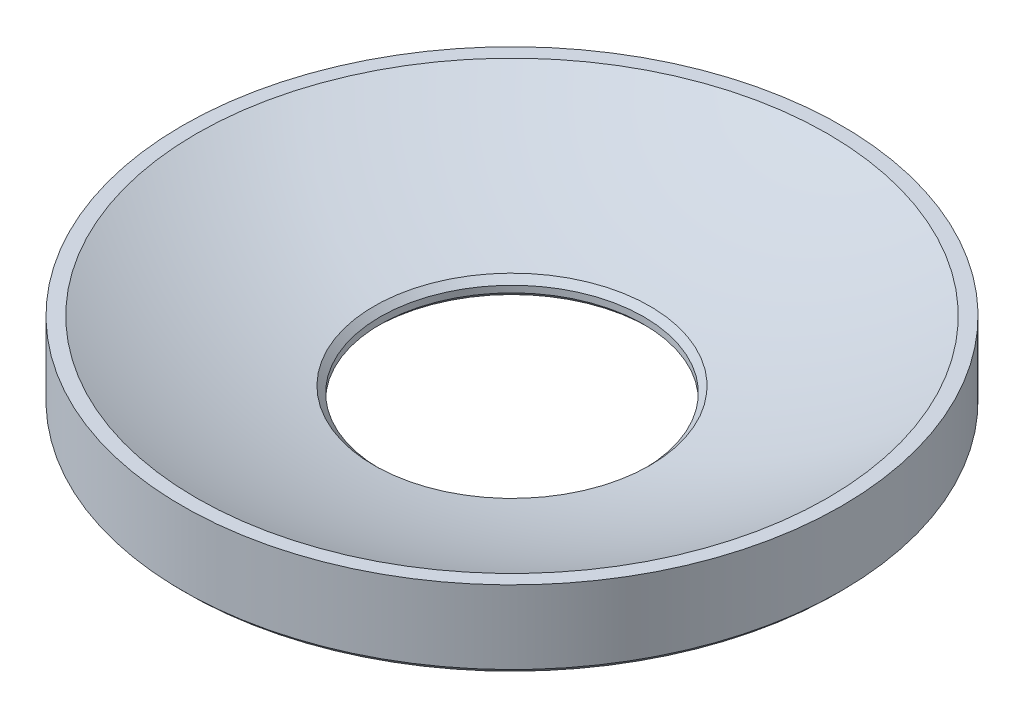
ISO-10303-21;
HEADER;
FILE_DESCRIPTION(('STEP AP214'),'2;1');
FILE_NAME('part.step','',(''),(''),'','','');
FILE_SCHEMA(('AUTOMOTIVE_DESIGN { 1 0 10303 214 1 1 1 1 }'));
ENDSEC;
DATA;
#1=APPLICATION_CONTEXT('core data for automotive mechanical design processes');
#2=APPLICATION_PROTOCOL_DEFINITION('international standard','automotive_design',2000,#1);
#3=PRODUCT_CONTEXT('',#1,'mechanical');
#4=PRODUCT('Part','Part','',(#3));
#5=PRODUCT_RELATED_PRODUCT_CATEGORY('part','',(#4));
#6=PRODUCT_DEFINITION_FORMATION('','',#4);
#7=PRODUCT_DEFINITION_CONTEXT('part definition',#1,'design');
#8=PRODUCT_DEFINITION('design','',#6,#7);
#9=PRODUCT_DEFINITION_SHAPE('','',#8);
#10=(LENGTH_UNIT() NAMED_UNIT(*) SI_UNIT(.MILLI.,.METRE.));
#11=(NAMED_UNIT(*) PLANE_ANGLE_UNIT() SI_UNIT($,.RADIAN.));
#12=(NAMED_UNIT(*) SI_UNIT($,.STERADIAN.) SOLID_ANGLE_UNIT());
#13=UNCERTAINTY_MEASURE_WITH_UNIT(LENGTH_MEASURE(1.E-05),#10,'distance_accuracy_value','');
#14=(GEOMETRIC_REPRESENTATION_CONTEXT(3) GLOBAL_UNCERTAINTY_ASSIGNED_CONTEXT((#13)) GLOBAL_UNIT_ASSIGNED_CONTEXT((#10,
#11,#12)) REPRESENTATION_CONTEXT('',''));
#15=CARTESIAN_POINT('',(0.,0.,0.));
#16=DIRECTION('',(0.,0.,1.));
#17=DIRECTION('',(1.,0.,0.));
#18=AXIS2_PLACEMENT_3D('',#15,#16,#17);
#19=CARTESIAN_POINT('',(0.,0.249260348555203,0.));
#20=DIRECTION('',(0.,-1.,0.));
#21=DIRECTION('',(1.,0.,0.));
#22=AXIS2_PLACEMENT_3D('',#19,#20,#21);
#23=CYLINDRICAL_SURFACE('',#22,20.);
#24=CARTESIAN_POINT('',(0.,0.300000000000005,0.));
#25=DIRECTION('',(0.,-1.,0.));
#26=DIRECTION('',(1.,0.,0.));
#27=AXIS2_PLACEMENT_3D('',#24,#25,#26);
#28=CIRCLE('',#27,20.);
#29=CARTESIAN_POINT('',(-20.,0.300000000000006,0.));
#30=VERTEX_POINT('',#29);
#31=EDGE_CURVE('E10',#30,#30,#28,.F.);
#32=ORIENTED_EDGE('',*,*,#31,.T.);
#33=EDGE_LOOP('',(#32));
#34=FACE_BOUND('',#33,.T.);
#35=CARTESIAN_POINT('',(0.,4.74926034855551,0.));
#36=DIRECTION('',(0.,-1.,0.));
#37=DIRECTION('',(1.,0.,0.));
#38=AXIS2_PLACEMENT_3D('',#35,#36,#37);
#39=CIRCLE('',#38,20.);
#40=CARTESIAN_POINT('',(20.,4.74926034855551,0.));
#41=VERTEX_POINT('',#40);
#42=EDGE_CURVE('E57',#41,#41,#39,.T.);
#43=ORIENTED_EDGE('',*,*,#42,.T.);
#44=EDGE_LOOP('',(#43));
#45=FACE_BOUND('',#44,.T.);
#46=ADVANCED_FACE('F31',(#34,#45),#23,.T.);
#47=CARTESIAN_POINT('',(20.,4.74926034855551,0.));
#48=DIRECTION('',(0.,1.,0.));
#49=DIRECTION('',(-1.,0.,0.));
#50=AXIS2_PLACEMENT_3D('',#47,#48,#49);
#51=PLANE('',#50);
#52=CARTESIAN_POINT('',(0.,4.74926034855551,0.));
#53=DIRECTION('',(0.,-1.,0.));
#54=DIRECTION('',(1.,0.,0.));
#55=AXIS2_PLACEMENT_3D('',#52,#53,#54);
#56=CIRCLE('',#55,19.1507180022061);
#57=CARTESIAN_POINT('',(19.1507180022061,4.74926034855551,0.));
#58=VERTEX_POINT('',#57);
#59=EDGE_CURVE('E60',#58,#58,#56,.T.);
#60=ORIENTED_EDGE('',*,*,#59,.T.);
#61=EDGE_LOOP('',(#60));
#62=FACE_BOUND('',#61,.T.);
#63=ORIENTED_EDGE('',*,*,#42,.F.);
#64=EDGE_LOOP('',(#63));
#65=FACE_BOUND('',#64,.T.);
#66=ADVANCED_FACE('F64',(#62,#65),#51,.T.);
#67=CARTESIAN_POINT('',(0.,43.2492603485552,0.));
#68=DIRECTION('',(0.,-1.,0.));
#69=DIRECTION('',(1.,0.,0.));
#70=AXIS2_PLACEMENT_3D('',#67,#68,#69);
#71=SPHERICAL_SURFACE('',#70,43.);
#72=CARTESIAN_POINT('',(0.,1.07217267385787,0.));
#73=DIRECTION('',(0.,1.,0.));
#74=DIRECTION('',(-1.,0.,0.));
#75=AXIS2_PLACEMENT_3D('',#72,#73,#74);
#76=CIRCLE('',#75,8.37217267385787);
#77=CARTESIAN_POINT('',(8.37217267385789,1.07217267385786,0.));
#78=VERTEX_POINT('',#77);
#79=EDGE_CURVE('E54',#78,#78,#76,.F.);
#80=CARTESIAN_POINT('',(8.37217267385789,1.07217267385786,0.));
#81=CARTESIAN_POINT('',(8.48887543388993,1.09533821673783,0.));
#82=CARTESIAN_POINT('',(8.60548204146638,1.11898815275597,0.));
#83=CARTESIAN_POINT('',(8.83849492784714,1.16725512892019,0.));
#84=CARTESIAN_POINT('',(8.95490120665145,1.19187216906628,0.));
#85=CARTESIAN_POINT('',(9.18750541162692,1.24207167133803,0.));
#86=CARTESIAN_POINT('',(9.30370333779808,1.26765413346369,0.));
#87=CARTESIAN_POINT('',(9.53588283170143,1.31978271316843,0.));
#88=CARTESIAN_POINT('',(9.65186439943361,1.34632883074751,0.));
#89=CARTESIAN_POINT('',(9.88360318457021,1.40038289321693,0.));
#90=CARTESIAN_POINT('',(9.99936040197463,1.42789083810728,0.));
#91=CARTESIAN_POINT('',(10.2306425102913,1.48386665950062,0.));
#92=CARTESIAN_POINT('',(10.3461674012036,1.51233453600361,0.));
#93=CARTESIAN_POINT('',(10.5769768963087,1.57022825912333,0.));
#94=CARTESIAN_POINT('',(10.6922615005016,1.59965410574006,0.));
#95=CARTESIAN_POINT('',(10.9225824785168,1.65946174148757,0.));
#96=CARTESIAN_POINT('',(11.0376188523391,1.68984353061837,0.));
#97=CARTESIAN_POINT('',(11.2674354430611,1.75156095795007,0.));
#98=CARTESIAN_POINT('',(11.3822156599607,1.78289659615098,0.));
#99=CARTESIAN_POINT('',(11.6115120279371,1.84651956244763,0.));
#100=CARTESIAN_POINT('',(11.7260281790138,1.87880689054337,0.));
#101=CARTESIAN_POINT('',(11.954788524639,1.94433101188024,0.));
#102=CARTESIAN_POINT('',(12.0690327191875,1.97756780512136,0.));
#103=CARTESIAN_POINT('',(12.2972412797902,2.04498856657641,0.));
#104=CARTESIAN_POINT('',(12.4112056458444,2.07917253479033,0.));
#105=CARTESIAN_POINT('',(12.6388466967739,2.1484852907537,0.));
#106=CARTESIAN_POINT('',(12.7525233816492,2.18361407850315,0.));
#107=CARTESIAN_POINT('',(12.979581237359,2.25481405299769,0.));
#108=CARTESIAN_POINT('',(13.0929624081934,2.29088523974278,0.));
#109=CARTESIAN_POINT('',(13.3194214233217,2.36396752675302,0.));
#110=CARTESIAN_POINT('',(13.4324992676156,2.40097862701816,0.));
#111=CARTESIAN_POINT('',(13.6583438380638,2.47593819082839,0.));
#112=CARTESIAN_POINT('',(13.771110564218,2.51388665437347,0.));
#113=CARTESIAN_POINT('',(13.9963251282255,2.5907183299147,0.));
#114=CARTESIAN_POINT('',(14.1087729660786,2.62960154191085,0.));
#115=CARTESIAN_POINT('',(14.3333420052952,2.70830003511675,0.));
#116=CARTESIAN_POINT('',(14.4454632066586,2.7481153163265,0.));
#117=CARTESIAN_POINT('',(14.6693712472139,2.82867520449815,0.));
#118=CARTESIAN_POINT('',(14.7811580864057,2.86941981146005,0.));
#119=CARTESIAN_POINT('',(15.0043896999752,2.95183554363959,0.));
#120=CARTESIAN_POINT('',(15.1158344743529,2.99350666885724,0.));
#121=CARTESIAN_POINT('',(15.3383742792211,3.07777256621039,0.));
#122=CARTESIAN_POINT('',(15.4494693097117,3.1203673383459,0.));
#123=CARTESIAN_POINT('',(15.6713019718322,3.20647759455321,0.));
#124=CARTESIAN_POINT('',(15.782039603462,3.24999307862501,0.));
#125=CARTESIAN_POINT('',(16.0031498375135,3.33794176028204,0.));
#126=CARTESIAN_POINT('',(16.1135224399352,3.38237495786727,0.));
#127=CARTESIAN_POINT('',(16.3338950103756,3.47215600489306,0.));
#128=CARTESIAN_POINT('',(16.4438949783943,3.51750385433362,0.));
#129=CARTESIAN_POINT('',(16.6635147005091,3.60911108038974,0.));
#130=CARTESIAN_POINT('',(16.7731344546054,3.6553704570053,0.));
#131=CARTESIAN_POINT('',(16.9919861955574,3.74879754991649,0.));
#132=CARTESIAN_POINT('',(17.1012181824133,3.79596526621212,0.));
#133=CARTESIAN_POINT('',(17.3192868622747,3.89120578842225,0.));
#134=CARTESIAN_POINT('',(17.4281235552802,3.93927859433676,0.));
#135=CARTESIAN_POINT('',(17.6453941481098,4.03632598327399,0.));
#136=CARTESIAN_POINT('',(17.7538280479339,4.0853005662967,0.));
#137=CARTESIAN_POINT('',(17.9702855826701,4.18414813511835,0.));
#138=CARTESIAN_POINT('',(18.0783092175823,4.23402112091729,0.));
#139=CARTESIAN_POINT('',(18.2939387796068,4.33466205787817,0.));
#140=CARTESIAN_POINT('',(18.4015447067192,4.38543000904013,0.));
#141=CARTESIAN_POINT('',(18.6163314368985,4.48785738203907,0.));
#142=CARTESIAN_POINT('',(18.7235122399655,4.53951680387605,0.));
#143=CARTESIAN_POINT('',(18.937441343087,4.64372354571728,0.));
#144=CARTESIAN_POINT('',(19.0441896431415,4.69627086572153,0.));
#145=CARTESIAN_POINT('',(19.1507180022061,4.74926034855551,0.));
#146=B_SPLINE_CURVE_WITH_KNOTS('',3,(#80,#81,#82,#83,#84,#85,#86,#87,#88,#89,#90,#91,#92,#93,
#94,#95,#96,#97,#98,#99,#100,#101,#102,#103,#104,#105,#106,#107,#108,#109,#110,#111,#112,#113,
#114,#115,#116,#117,#118,#119,#120,#121,#122,#123,#124,#125,#126,#127,#128,#129,#130,#131,#132,
#133,#134,#135,#136,#137,#138,#139,#140,#141,#142,#143,#144,#145),.UNSPECIFIED.,.F.,.F.,(4,2,2,
2,2,2,2,2,2,2,2,2,2,2,2,2,2,2,2,2,2,2,2,2,2,2,2,2,2,2,2,2,4),(0.,0.356938170276641,
0.713876340553283,1.07081451082994,1.42775268110657,1.78469085138322,2.14162902165986,
2.4985671919365,2.85550536221315,3.21244353248979,3.56938170276643,3.92631987304307,
4.28325804331971,4.64019621359635,4.997134383873,5.35407255414964,5.71101072442629,
6.06794889470292,6.42488706497957,6.78182523525621,7.13876340553286,7.4957015758095,
7.85263974608614,8.20957791636279,8.56651608663943,8.92345425691608,9.28039242719272,
9.63733059746936,9.994268767746,10.3512069380226,10.7081451082993,11.0650832785759,
11.4220214488526),.UNSPECIFIED.);
#147=EDGE_CURVE('BSEAM67',#78,#58,#146,.T.);
#148=ORIENTED_EDGE('',*,*,#79,.T.);
#149=ORIENTED_EDGE('',*,*,#59,.F.);
#150=ORIENTED_EDGE('',*,*,#147,.T.);
#151=ORIENTED_EDGE('',*,*,#147,.F.);
#152=EDGE_LOOP('',(#148,#150,#149,#151));
#153=FACE_BOUND('',#152,.T.);
#154=ADVANCED_FACE('F67',(#153),#71,.F.);
#155=CARTESIAN_POINT('',(0.,0.249260348555203,0.));
#156=DIRECTION('',(0.,-1.,0.));
#157=DIRECTION('',(1.,0.,0.));
#158=AXIS2_PLACEMENT_3D('',#155,#156,#157);
#159=CYLINDRICAL_SURFACE('',#158,8.);
#160=CARTESIAN_POINT('',(0.,0.699999999999978,0.));
#161=DIRECTION('',(0.,1.,0.));
#162=DIRECTION('',(-1.,0.,0.));
#163=AXIS2_PLACEMENT_3D('',#160,#161,#162);
#164=CIRCLE('',#163,8.);
#165=CARTESIAN_POINT('',(-8.,0.699999999999978,0.));
#166=VERTEX_POINT('',#165);
#167=EDGE_CURVE('E46',#166,#166,#164,.T.);
#168=ORIENTED_EDGE('',*,*,#167,.T.);
#169=EDGE_LOOP('',(#168));
#170=FACE_BOUND('',#169,.T.);
#171=CARTESIAN_POINT('',(0.,0.300000000000002,0.));
#172=DIRECTION('',(0.,-1.,0.));
#173=DIRECTION('',(1.,0.,0.));
#174=AXIS2_PLACEMENT_3D('',#171,#172,#173);
#175=CIRCLE('',#174,8.);
#176=CARTESIAN_POINT('',(8.,0.300000000000002,0.));
#177=VERTEX_POINT('',#176);
#178=EDGE_CURVE('E51',#177,#177,#175,.T.);
#179=ORIENTED_EDGE('',*,*,#178,.T.);
#180=EDGE_LOOP('',(#179));
#181=FACE_BOUND('',#180,.T.);
#182=ADVANCED_FACE('F69',(#170,#181),#159,.F.);
#183=CARTESIAN_POINT('',(8.,0.,0.));
#184=DIRECTION('',(0.,-1.,0.));
#185=DIRECTION('',(1.,0.,0.));
#186=AXIS2_PLACEMENT_3D('',#183,#184,#185);
#187=PLANE('',#186);
#188=CARTESIAN_POINT('',(0.,0.,0.));
#189=DIRECTION('',(0.,-1.,0.));
#190=DIRECTION('',(1.,0.,0.));
#191=AXIS2_PLACEMENT_3D('',#188,#189,#190);
#192=CIRCLE('',#191,8.3);
#193=CARTESIAN_POINT('',(8.3,0.,0.));
#194=VERTEX_POINT('',#193);
#195=EDGE_CURVE('E38',#194,#194,#192,.F.);
#196=ORIENTED_EDGE('',*,*,#195,.T.);
#197=EDGE_LOOP('',(#196));
#198=FACE_BOUND('',#197,.T.);
#199=CARTESIAN_POINT('',(0.,0.,0.));
#200=DIRECTION('',(0.,-1.,0.));
#201=DIRECTION('',(1.,0.,0.));
#202=AXIS2_PLACEMENT_3D('',#199,#200,#201);
#203=CIRCLE('',#202,19.7);
#204=CARTESIAN_POINT('',(-19.7,0.,0.));
#205=VERTEX_POINT('',#204);
#206=EDGE_CURVE('E42',#205,#205,#203,.T.);
#207=ORIENTED_EDGE('',*,*,#206,.T.);
#208=EDGE_LOOP('',(#207));
#209=FACE_BOUND('',#208,.T.);
#210=ADVANCED_FACE('F76',(#198,#209),#187,.T.);
#211=CARTESIAN_POINT('',(0.,1.07217267385785,0.));
#212=DIRECTION('',(0.,1.,0.));
#213=DIRECTION('',(-1.,0.,0.));
#214=AXIS2_PLACEMENT_3D('',#211,#212,#213);
#215=CONICAL_SURFACE('',#214,8.37217267385787,0.785398163397434);
#216=ORIENTED_EDGE('',*,*,#167,.F.);
#217=EDGE_LOOP('',(#216));
#218=FACE_BOUND('',#217,.T.);
#219=ORIENTED_EDGE('',*,*,#79,.F.);
#220=EDGE_LOOP('',(#219));
#221=FACE_BOUND('',#220,.T.);
#222=ADVANCED_FACE('F86',(#218,#221),#215,.F.);
#223=CARTESIAN_POINT('',(0.,0.300000000000002,0.));
#224=DIRECTION('',(0.,-1.,0.));
#225=DIRECTION('',(1.,0.,0.));
#226=AXIS2_PLACEMENT_3D('',#223,#224,#225);
#227=CONICAL_SURFACE('',#226,8.,0.785398163397448);
#228=ORIENTED_EDGE('',*,*,#195,.F.);
#229=EDGE_LOOP('',(#228));
#230=FACE_BOUND('',#229,.T.);
#231=ORIENTED_EDGE('',*,*,#178,.F.);
#232=EDGE_LOOP('',(#231));
#233=FACE_BOUND('',#232,.T.);
#234=ADVANCED_FACE('F88',(#230,#233),#227,.F.);
#235=CARTESIAN_POINT('',(0.,0.,0.));
#236=DIRECTION('',(0.,1.,0.));
#237=DIRECTION('',(-1.,0.,0.));
#238=AXIS2_PLACEMENT_3D('',#235,#236,#237);
#239=CONICAL_SURFACE('',#238,19.7,0.785398163397448);
#240=CARTESIAN_POINT('',(-20.,0.300000000000006,0.));
#241=CARTESIAN_POINT('',(-19.996875,0.296875000000005,0.));
#242=CARTESIAN_POINT('',(-19.99375,0.293750000000005,0.));
#243=CARTESIAN_POINT('',(-19.9875,0.287500000000005,0.));
#244=CARTESIAN_POINT('',(-19.984375,0.284375000000006,0.));
#245=CARTESIAN_POINT('',(-19.978125,0.278125000000006,0.));
#246=CARTESIAN_POINT('',(-19.975,0.275000000000005,0.));
#247=CARTESIAN_POINT('',(-19.96875,0.268750000000005,0.));
#248=CARTESIAN_POINT('',(-19.965625,0.265625000000005,0.));
#249=CARTESIAN_POINT('',(-19.959375,0.259375000000005,0.));
#250=CARTESIAN_POINT('',(-19.95625,0.256250000000005,0.));
#251=CARTESIAN_POINT('',(-19.95,0.250000000000005,0.));
#252=CARTESIAN_POINT('',(-19.946875,0.246875000000005,0.));
#253=CARTESIAN_POINT('',(-19.940625,0.240625000000004,0.));
#254=CARTESIAN_POINT('',(-19.9375,0.237500000000004,0.));
#255=CARTESIAN_POINT('',(-19.93125,0.231250000000004,0.));
#256=CARTESIAN_POINT('',(-19.928125,0.228125000000005,0.));
#257=CARTESIAN_POINT('',(-19.921875,0.221875000000005,0.));
#258=CARTESIAN_POINT('',(-19.91875,0.218750000000004,0.));
#259=CARTESIAN_POINT('',(-19.9125,0.212500000000004,0.));
#260=CARTESIAN_POINT('',(-19.909375,0.209375000000004,0.));
#261=CARTESIAN_POINT('',(-19.903125,0.203125000000004,0.));
#262=CARTESIAN_POINT('',(-19.9,0.200000000000004,0.));
#263=CARTESIAN_POINT('',(-19.89375,0.193750000000004,0.));
#264=CARTESIAN_POINT('',(-19.890625,0.190625000000004,0.));
#265=CARTESIAN_POINT('',(-19.884375,0.184375000000003,0.));
#266=CARTESIAN_POINT('',(-19.88125,0.181250000000003,0.));
#267=CARTESIAN_POINT('',(-19.875,0.175000000000003,0.));
#268=CARTESIAN_POINT('',(-19.871875,0.171875000000004,0.));
#269=CARTESIAN_POINT('',(-19.865625,0.165625000000004,0.));
#270=CARTESIAN_POINT('',(-19.8625,0.162500000000003,0.));
#271=CARTESIAN_POINT('',(-19.85625,0.156250000000003,0.));
#272=CARTESIAN_POINT('',(-19.853125,0.153125000000003,0.));
#273=CARTESIAN_POINT('',(-19.846875,0.146875000000003,0.));
#274=CARTESIAN_POINT('',(-19.84375,0.143750000000003,0.));
#275=CARTESIAN_POINT('',(-19.8375,0.137500000000003,0.));
#276=CARTESIAN_POINT('',(-19.834375,0.134375000000002,0.));
#277=CARTESIAN_POINT('',(-19.828125,0.128125000000002,0.));
#278=CARTESIAN_POINT('',(-19.825,0.125000000000003,0.));
#279=CARTESIAN_POINT('',(-19.81875,0.118750000000003,0.));
#280=CARTESIAN_POINT('',(-19.815625,0.115625000000003,0.));
#281=CARTESIAN_POINT('',(-19.809375,0.109375000000002,0.));
#282=CARTESIAN_POINT('',(-19.80625,0.106250000000002,0.));
#283=CARTESIAN_POINT('',(-19.8,0.100000000000002,0.));
#284=CARTESIAN_POINT('',(-19.796875,0.0968750000000023,0.));
#285=CARTESIAN_POINT('',(-19.790625,0.0906250000000024,0.));
#286=CARTESIAN_POINT('',(-19.7875,0.0875000000000021,0.));
#287=CARTESIAN_POINT('',(-19.78125,0.0812500000000016,0.));
#288=CARTESIAN_POINT('',(-19.778125,0.0781250000000014,0.));
#289=CARTESIAN_POINT('',(-19.771875,0.0718750000000015,0.));
#290=CARTESIAN_POINT('',(-19.76875,0.0687500000000018,0.));
#291=CARTESIAN_POINT('',(-19.7625,0.0625000000000019,0.));
#292=CARTESIAN_POINT('',(-19.759375,0.0593750000000016,0.));
#293=CARTESIAN_POINT('',(-19.753125,0.0531250000000011,0.));
#294=CARTESIAN_POINT('',(-19.75,0.0500000000000009,0.));
#295=CARTESIAN_POINT('',(-19.74375,0.043750000000001,0.));
#296=CARTESIAN_POINT('',(-19.740625,0.0406250000000013,0.));
#297=CARTESIAN_POINT('',(-19.734375,0.0343750000000014,0.));
#298=CARTESIAN_POINT('',(-19.73125,0.0312500000000011,0.));
#299=CARTESIAN_POINT('',(-19.725,0.0250000000000007,0.));
#300=CARTESIAN_POINT('',(-19.721875,0.0218750000000004,0.));
#301=CARTESIAN_POINT('',(-19.715625,0.0156250000000004,0.));
#302=CARTESIAN_POINT('',(-19.7125,0.0125000000000006,0.));
#303=CARTESIAN_POINT('',(-19.70625,0.00625000000000108,0.));
#304=CARTESIAN_POINT('',(-19.703125,0.00312500000000129,0.));
#305=CARTESIAN_POINT('',(-19.7,0.,0.));
#306=B_SPLINE_CURVE_WITH_KNOTS('',3,(#240,#241,#242,#243,#244,#245,#246,#247,#248,#249,#250,
#251,#252,#253,#254,#255,#256,#257,#258,#259,#260,#261,#262,#263,#264,#265,#266,#267,#268,#269,
#270,#271,#272,#273,#274,#275,#276,#277,#278,#279,#280,#281,#282,#283,#284,#285,#286,#287,#288,
#289,#290,#291,#292,#293,#294,#295,#296,#297,#298,#299,#300,#301,#302,#303,#304,#305),
.UNSPECIFIED.,.F.,.F.,(4,2,2,2,2,2,2,2,2,2,2,2,2,2,2,2,2,2,2,2,2,2,2,2,2,2,2,2,2,2,2,2,4),(0.,
0.0132582521472471,0.0265165042944967,0.0397747564417439,0.053033008588991,0.0662912607362407,
0.0795495128834878,0.092807765030735,0.106066017177985,0.119324269325232,0.132582521472479,
0.145840773619728,0.159099025766976,0.172357277914223,0.185615530061472,0.19887378220872,
0.212132034355967,0.225390286503216,0.238648538650464,0.251906790797713,0.26516504294496,
0.278423295092207,0.291681547239457,0.304939799386704,0.318198051533951,0.331456303681201,
0.344714555828448,0.357972807975695,0.371231060122945,0.384489312270192,0.397747564417439,
0.411005816564689,0.424264068711936),.UNSPECIFIED.);
#307=EDGE_CURVE('BSEAM33',#30,#205,#306,.T.);
#308=ORIENTED_EDGE('',*,*,#31,.F.);
#309=ORIENTED_EDGE('',*,*,#206,.F.);
#310=ORIENTED_EDGE('',*,*,#307,.T.);
#311=ORIENTED_EDGE('',*,*,#307,.F.);
#312=EDGE_LOOP('',(#308,#310,#309,#311));
#313=FACE_BOUND('',#312,.T.);
#314=ADVANCED_FACE('F33',(#313),#239,.T.);
#315=CLOSED_SHELL('',(#46,#66,#154,#182,#210,#222,#234,#314));
#316=MANIFOLD_SOLID_BREP('B2',#315);
#317=ADVANCED_BREP_SHAPE_REPRESENTATION('',(#18,#316),#14);
#318=SHAPE_DEFINITION_REPRESENTATION(#9,#317);
ENDSEC;
END-ISO-10303-21;
